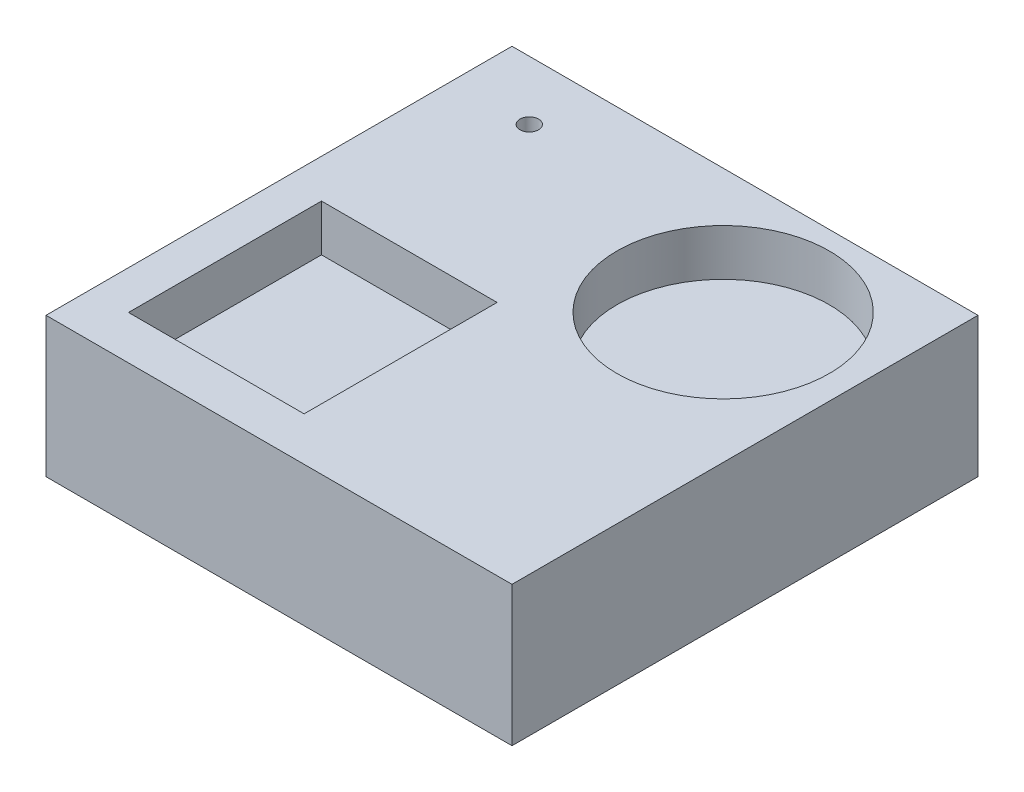
ISO-10303-21;
HEADER;
FILE_DESCRIPTION(('STEP AP214'),'2;1');
FILE_NAME('part.step','',(''),(''),'','','');
FILE_SCHEMA(('AUTOMOTIVE_DESIGN { 1 0 10303 214 1 1 1 1 }'));
ENDSEC;
DATA;
#1=APPLICATION_CONTEXT('core data for automotive mechanical design processes');
#2=APPLICATION_PROTOCOL_DEFINITION('international standard','automotive_design',2000,#1);
#3=PRODUCT_CONTEXT('',#1,'mechanical');
#4=PRODUCT('Part','Part','',(#3));
#5=PRODUCT_RELATED_PRODUCT_CATEGORY('part','',(#4));
#6=PRODUCT_DEFINITION_FORMATION('','',#4);
#7=PRODUCT_DEFINITION_CONTEXT('part definition',#1,'design');
#8=PRODUCT_DEFINITION('design','',#6,#7);
#9=PRODUCT_DEFINITION_SHAPE('','',#8);
#10=(LENGTH_UNIT() NAMED_UNIT(*) SI_UNIT(.MILLI.,.METRE.));
#11=(NAMED_UNIT(*) PLANE_ANGLE_UNIT() SI_UNIT($,.RADIAN.));
#12=(NAMED_UNIT(*) SI_UNIT($,.STERADIAN.) SOLID_ANGLE_UNIT());
#13=UNCERTAINTY_MEASURE_WITH_UNIT(LENGTH_MEASURE(1.E-05),#10,'distance_accuracy_value','');
#14=(GEOMETRIC_REPRESENTATION_CONTEXT(3) GLOBAL_UNCERTAINTY_ASSIGNED_CONTEXT((#13)) GLOBAL_UNIT_ASSIGNED_CONTEXT((#10,
#11,#12)) REPRESENTATION_CONTEXT('',''));
#15=CARTESIAN_POINT('',(0.,0.,0.));
#16=DIRECTION('',(0.,0.,1.));
#17=DIRECTION('',(1.,0.,0.));
#18=AXIS2_PLACEMENT_3D('',#15,#16,#17);
#19=CARTESIAN_POINT('',(0.,30.,0.));
#20=DIRECTION('',(1.,0.,0.));
#21=DIRECTION('',(0.,0.,-1.));
#22=AXIS2_PLACEMENT_3D('',#19,#20,#21);
#23=PLANE('',#22);
#24=DIRECTION('',(0.,0.,1.));
#25=VECTOR('',#24,1.);
#26=CARTESIAN_POINT('',(0.,0.,0.));
#27=LINE('',#26,#25);
#28=CARTESIAN_POINT('',(0.,0.,-100.));
#29=VERTEX_POINT('',#28);
#30=CARTESIAN_POINT('',(0.,0.,0.));
#31=VERTEX_POINT('',#30);
#32=EDGE_CURVE('E252',#29,#31,#27,.T.);
#33=ORIENTED_EDGE('',*,*,#32,.T.);
#34=DIRECTION('',(0.,-1.,0.));
#35=VECTOR('',#34,1.);
#36=CARTESIAN_POINT('',(0.,30.,0.));
#37=LINE('',#36,#35);
#38=CARTESIAN_POINT('',(0.,30.,0.));
#39=VERTEX_POINT('',#38);
#40=EDGE_CURVE('E12',#39,#31,#37,.T.);
#41=ORIENTED_EDGE('',*,*,#40,.F.);
#42=DIRECTION('',(0.,0.,1.));
#43=VECTOR('',#42,1.);
#44=CARTESIAN_POINT('',(0.,30.,0.));
#45=LINE('',#44,#43);
#46=CARTESIAN_POINT('',(0.,30.,-100.));
#47=VERTEX_POINT('',#46);
#48=EDGE_CURVE('E235',#47,#39,#45,.T.);
#49=ORIENTED_EDGE('',*,*,#48,.F.);
#50=DIRECTION('',(0.,-1.,0.));
#51=VECTOR('',#50,1.);
#52=CARTESIAN_POINT('',(0.,30.,-100.));
#53=LINE('',#52,#51);
#54=EDGE_CURVE('E251',#47,#29,#53,.T.);
#55=ORIENTED_EDGE('',*,*,#54,.T.);
#56=EDGE_LOOP('',(#33,#41,#49,#55));
#57=FACE_BOUND('',#56,.T.);
#58=ADVANCED_FACE('F47',(#57),#23,.F.);
#59=CARTESIAN_POINT('',(0.,30.,0.));
#60=DIRECTION('',(0.,0.,-1.));
#61=DIRECTION('',(-1.,0.,0.));
#62=AXIS2_PLACEMENT_3D('',#59,#60,#61);
#63=PLANE('',#62);
#64=DIRECTION('',(1.,0.,0.));
#65=VECTOR('',#64,1.);
#66=CARTESIAN_POINT('',(0.,0.,0.));
#67=LINE('',#66,#65);
#68=CARTESIAN_POINT('',(100.,0.,0.));
#69=VERTEX_POINT('',#68);
#70=EDGE_CURVE('E256',#31,#69,#67,.T.);
#71=ORIENTED_EDGE('',*,*,#70,.T.);
#72=DIRECTION('',(0.,-1.,0.));
#73=VECTOR('',#72,1.);
#74=CARTESIAN_POINT('',(100.,30.,0.));
#75=LINE('',#74,#73);
#76=CARTESIAN_POINT('',(100.,30.,0.));
#77=VERTEX_POINT('',#76);
#78=EDGE_CURVE('E55',#77,#69,#75,.T.);
#79=ORIENTED_EDGE('',*,*,#78,.F.);
#80=DIRECTION('',(1.,0.,0.));
#81=VECTOR('',#80,1.);
#82=CARTESIAN_POINT('',(0.,30.,0.));
#83=LINE('',#82,#81);
#84=EDGE_CURVE('E99',#39,#77,#83,.T.);
#85=ORIENTED_EDGE('',*,*,#84,.F.);
#86=ORIENTED_EDGE('',*,*,#40,.T.);
#87=EDGE_LOOP('',(#71,#79,#85,#86));
#88=FACE_BOUND('',#87,.T.);
#89=ADVANCED_FACE('F311',(#88),#63,.F.);
#90=CARTESIAN_POINT('',(100.,30.,0.));
#91=DIRECTION('',(-1.,0.,0.));
#92=DIRECTION('',(0.,0.,1.));
#93=AXIS2_PLACEMENT_3D('',#90,#91,#92);
#94=PLANE('',#93);
#95=DIRECTION('',(0.,0.,-1.));
#96=VECTOR('',#95,1.);
#97=CARTESIAN_POINT('',(100.,0.,0.));
#98=LINE('',#97,#96);
#99=CARTESIAN_POINT('',(100.,0.,-100.));
#100=VERTEX_POINT('',#99);
#101=EDGE_CURVE('E259',#69,#100,#98,.T.);
#102=ORIENTED_EDGE('',*,*,#101,.T.);
#103=DIRECTION('',(0.,-1.,0.));
#104=VECTOR('',#103,1.);
#105=CARTESIAN_POINT('',(100.,30.,-100.));
#106=LINE('',#105,#104);
#107=CARTESIAN_POINT('',(100.,30.,-100.));
#108=VERTEX_POINT('',#107);
#109=EDGE_CURVE('E286',#108,#100,#106,.T.);
#110=ORIENTED_EDGE('',*,*,#109,.F.);
#111=DIRECTION('',(0.,0.,-1.));
#112=VECTOR('',#111,1.);
#113=CARTESIAN_POINT('',(100.,30.,0.));
#114=LINE('',#113,#112);
#115=EDGE_CURVE('E245',#77,#108,#114,.T.);
#116=ORIENTED_EDGE('',*,*,#115,.F.);
#117=ORIENTED_EDGE('',*,*,#78,.T.);
#118=EDGE_LOOP('',(#102,#110,#116,#117));
#119=FACE_BOUND('',#118,.T.);
#120=ADVANCED_FACE('F293',(#119),#94,.F.);
#121=CARTESIAN_POINT('',(0.,30.,-100.));
#122=DIRECTION('',(0.,0.,1.));
#123=DIRECTION('',(1.,0.,0.));
#124=AXIS2_PLACEMENT_3D('',#121,#122,#123);
#125=PLANE('',#124);
#126=DIRECTION('',(-1.,0.,0.));
#127=VECTOR('',#126,1.);
#128=CARTESIAN_POINT('',(0.,0.,-100.));
#129=LINE('',#128,#127);
#130=EDGE_CURVE('E92',#100,#29,#129,.T.);
#131=ORIENTED_EDGE('',*,*,#130,.T.);
#132=ORIENTED_EDGE('',*,*,#54,.F.);
#133=DIRECTION('',(-1.,0.,0.));
#134=VECTOR('',#133,1.);
#135=CARTESIAN_POINT('',(0.,30.,-100.));
#136=LINE('',#135,#134);
#137=EDGE_CURVE('E71',#108,#47,#136,.T.);
#138=ORIENTED_EDGE('',*,*,#137,.F.);
#139=ORIENTED_EDGE('',*,*,#109,.T.);
#140=EDGE_LOOP('',(#131,#132,#138,#139));
#141=FACE_BOUND('',#140,.T.);
#142=ADVANCED_FACE('F301',(#141),#125,.F.);
#143=CARTESIAN_POINT('',(0.,30.,0.));
#144=DIRECTION('',(0.,-1.,0.));
#145=DIRECTION('',(0.,0.,-1.));
#146=AXIS2_PLACEMENT_3D('',#143,#144,#145);
#147=PLANE('',#146);
#148=DIRECTION('',(1.,0.,0.));
#149=VECTOR('',#148,1.);
#150=CARTESIAN_POINT('',(8.32789443786908,30.,-9.37411485810458));
#151=LINE('',#150,#149);
#152=CARTESIAN_POINT('',(8.32789443786908,30.,-9.37411485810458));
#153=VERTEX_POINT('',#152);
#154=CARTESIAN_POINT('',(46.0113838607228,30.,-9.37411485810458));
#155=VERTEX_POINT('',#154);
#156=EDGE_CURVE('E170',#153,#155,#151,.T.);
#157=ORIENTED_EDGE('',*,*,#156,.F.);
#158=DIRECTION('',(0.,0.,1.));
#159=VECTOR('',#158,1.);
#160=CARTESIAN_POINT('',(8.32789443786908,30.,-50.787427560806));
#161=LINE('',#160,#159);
#162=CARTESIAN_POINT('',(8.32789443786908,30.,-50.787427560806));
#163=VERTEX_POINT('',#162);
#164=EDGE_CURVE('E62',#163,#153,#161,.T.);
#165=ORIENTED_EDGE('',*,*,#164,.F.);
#166=DIRECTION('',(-1.,0.,0.));
#167=VECTOR('',#166,1.);
#168=CARTESIAN_POINT('',(8.32789443786908,30.,-50.787427560806));
#169=LINE('',#168,#167);
#170=CARTESIAN_POINT('',(46.0113838607228,30.,-50.787427560806));
#171=VERTEX_POINT('',#170);
#172=EDGE_CURVE('E145',#171,#163,#169,.T.);
#173=ORIENTED_EDGE('',*,*,#172,.F.);
#174=DIRECTION('',(0.,0.,-1.));
#175=VECTOR('',#174,1.);
#176=CARTESIAN_POINT('',(46.0113838607228,30.,-50.787427560806));
#177=LINE('',#176,#175);
#178=EDGE_CURVE('E149',#155,#171,#177,.T.);
#179=ORIENTED_EDGE('',*,*,#178,.F.);
#180=EDGE_LOOP('',(#157,#165,#173,#179));
#181=FACE_BOUND('',#180,.T.);
#182=CARTESIAN_POINT('',(72.0846402277573,30.,-73.2251707576097));
#183=DIRECTION('',(0.,1.,0.));
#184=DIRECTION('',(0.,0.,1.));
#185=AXIS2_PLACEMENT_3D('',#182,#183,#184);
#186=CIRCLE('',#185,22.7899638797003);
#187=CARTESIAN_POINT('',(72.0846402277573,30.,-50.4352068779094));
#188=VERTEX_POINT('',#187);
#189=EDGE_CURVE('E204',#188,#188,#186,.T.);
#190=ORIENTED_EDGE('',*,*,#189,.F.);
#191=EDGE_LOOP('',(#190));
#192=FACE_BOUND('',#191,.T.);
#193=CARTESIAN_POINT('',(16.3843135452169,30.,-87.3231980243077));
#194=DIRECTION('',(0.,1.,0.));
#195=DIRECTION('',(0.,0.,1.));
#196=AXIS2_PLACEMENT_3D('',#193,#194,#195);
#197=CIRCLE('',#196,2.);
#198=CARTESIAN_POINT('',(16.3843135452169,30.,-85.3231980243077));
#199=VERTEX_POINT('',#198);
#200=EDGE_CURVE('E188',#199,#199,#197,.T.);
#201=ORIENTED_EDGE('',*,*,#200,.F.);
#202=EDGE_LOOP('',(#201));
#203=FACE_BOUND('',#202,.T.);
#204=ORIENTED_EDGE('',*,*,#48,.T.);
#205=ORIENTED_EDGE('',*,*,#84,.T.);
#206=ORIENTED_EDGE('',*,*,#115,.T.);
#207=ORIENTED_EDGE('',*,*,#137,.T.);
#208=EDGE_LOOP('',(#204,#205,#206,#207));
#209=FACE_BOUND('',#208,.T.);
#210=ADVANCED_FACE('F303',(#181,#192,#203,#209),#147,.F.);
#211=CARTESIAN_POINT('',(0.,0.,0.));
#212=DIRECTION('',(0.,-1.,0.));
#213=DIRECTION('',(0.,0.,-1.));
#214=AXIS2_PLACEMENT_3D('',#211,#212,#213);
#215=PLANE('',#214);
#216=CARTESIAN_POINT('',(16.3843135452169,0.,-87.3231980243077));
#217=DIRECTION('',(0.,1.,0.));
#218=DIRECTION('',(0.,0.,1.));
#219=AXIS2_PLACEMENT_3D('',#216,#217,#218);
#220=CIRCLE('',#219,2.);
#221=CARTESIAN_POINT('',(16.3843135452169,0.,-85.3231980243077));
#222=VERTEX_POINT('',#221);
#223=EDGE_CURVE('E233',#222,#222,#220,.T.);
#224=ORIENTED_EDGE('',*,*,#223,.T.);
#225=EDGE_LOOP('',(#224));
#226=FACE_BOUND('',#225,.T.);
#227=ORIENTED_EDGE('',*,*,#32,.F.);
#228=ORIENTED_EDGE('',*,*,#130,.F.);
#229=ORIENTED_EDGE('',*,*,#101,.F.);
#230=ORIENTED_EDGE('',*,*,#70,.F.);
#231=EDGE_LOOP('',(#227,#228,#229,#230));
#232=FACE_BOUND('',#231,.T.);
#233=ADVANCED_FACE('F297',(#226,#232),#215,.T.);
#234=CARTESIAN_POINT('',(16.3843135452169,0.,-87.3231980243077));
#235=DIRECTION('',(0.,1.,0.));
#236=DIRECTION('',(0.,0.,1.));
#237=AXIS2_PLACEMENT_3D('',#234,#235,#236);
#238=CYLINDRICAL_SURFACE('',#237,2.);
#239=ORIENTED_EDGE('',*,*,#223,.F.);
#240=EDGE_LOOP('',(#239));
#241=FACE_BOUND('',#240,.T.);
#242=ORIENTED_EDGE('',*,*,#200,.T.);
#243=EDGE_LOOP('',(#242));
#244=FACE_BOUND('',#243,.T.);
#245=ADVANCED_FACE('F343',(#241,#244),#238,.F.);
#246=CARTESIAN_POINT('',(72.0846402277573,20.,-73.2251707576097));
#247=DIRECTION('',(0.,1.,0.));
#248=DIRECTION('',(0.,0.,1.));
#249=AXIS2_PLACEMENT_3D('',#246,#247,#248);
#250=CYLINDRICAL_SURFACE('',#249,22.7899638797003);
#251=CARTESIAN_POINT('',(72.0846402277573,20.,-73.2251707576097));
#252=DIRECTION('',(0.,1.,0.));
#253=DIRECTION('',(0.,0.,1.));
#254=AXIS2_PLACEMENT_3D('',#251,#252,#253);
#255=CIRCLE('',#254,22.7899638797003);
#256=CARTESIAN_POINT('',(72.0846402277573,20.,-50.4352068779094));
#257=VERTEX_POINT('',#256);
#258=EDGE_CURVE('E171',#257,#257,#255,.T.);
#259=ORIENTED_EDGE('',*,*,#258,.F.);
#260=EDGE_LOOP('',(#259));
#261=FACE_BOUND('',#260,.T.);
#262=ORIENTED_EDGE('',*,*,#189,.T.);
#263=EDGE_LOOP('',(#262));
#264=FACE_BOUND('',#263,.T.);
#265=ADVANCED_FACE('F350',(#261,#264),#250,.F.);
#266=CARTESIAN_POINT('',(72.0846402277573,20.,-73.2251707576097));
#267=DIRECTION('',(0.,1.,0.));
#268=DIRECTION('',(0.,0.,1.));
#269=AXIS2_PLACEMENT_3D('',#266,#267,#268);
#270=PLANE('',#269);
#271=ORIENTED_EDGE('',*,*,#258,.T.);
#272=EDGE_LOOP('',(#271));
#273=FACE_BOUND('',#272,.T.);
#274=ADVANCED_FACE('F360',(#273),#270,.T.);
#275=CARTESIAN_POINT('',(8.32789443786908,20.,-50.787427560806));
#276=DIRECTION('',(-1.,0.,0.));
#277=DIRECTION('',(0.,0.,1.));
#278=AXIS2_PLACEMENT_3D('',#275,#276,#277);
#279=PLANE('',#278);
#280=ORIENTED_EDGE('',*,*,#164,.T.);
#281=DIRECTION('',(0.,1.,0.));
#282=VECTOR('',#281,1.);
#283=CARTESIAN_POINT('',(8.32789443786908,20.,-9.37411485810458));
#284=LINE('',#283,#282);
#285=CARTESIAN_POINT('',(8.32789443786908,20.,-9.37411485810458));
#286=VERTEX_POINT('',#285);
#287=EDGE_CURVE('E119',#286,#153,#284,.T.);
#288=ORIENTED_EDGE('',*,*,#287,.F.);
#289=DIRECTION('',(0.,0.,1.));
#290=VECTOR('',#289,1.);
#291=CARTESIAN_POINT('',(8.32789443786908,20.,-50.787427560806));
#292=LINE('',#291,#290);
#293=CARTESIAN_POINT('',(8.32789443786908,20.,-50.787427560806));
#294=VERTEX_POINT('',#293);
#295=EDGE_CURVE('E123',#294,#286,#292,.T.);
#296=ORIENTED_EDGE('',*,*,#295,.F.);
#297=DIRECTION('',(0.,1.,0.));
#298=VECTOR('',#297,1.);
#299=CARTESIAN_POINT('',(8.32789443786908,20.,-50.787427560806));
#300=LINE('',#299,#298);
#301=EDGE_CURVE('E184',#294,#163,#300,.T.);
#302=ORIENTED_EDGE('',*,*,#301,.T.);
#303=EDGE_LOOP('',(#280,#288,#296,#302));
#304=FACE_BOUND('',#303,.T.);
#305=ADVANCED_FACE('F121',(#304),#279,.F.);
#306=CARTESIAN_POINT('',(8.32789443786908,20.,-50.787427560806));
#307=DIRECTION('',(0.,0.,-1.));
#308=DIRECTION('',(-1.,0.,0.));
#309=AXIS2_PLACEMENT_3D('',#306,#307,#308);
#310=PLANE('',#309);
#311=ORIENTED_EDGE('',*,*,#172,.T.);
#312=ORIENTED_EDGE('',*,*,#301,.F.);
#313=DIRECTION('',(-1.,0.,0.));
#314=VECTOR('',#313,1.);
#315=CARTESIAN_POINT('',(8.32789443786908,20.,-50.787427560806));
#316=LINE('',#315,#314);
#317=CARTESIAN_POINT('',(46.0113838607228,20.,-50.787427560806));
#318=VERTEX_POINT('',#317);
#319=EDGE_CURVE('E130',#318,#294,#316,.T.);
#320=ORIENTED_EDGE('',*,*,#319,.F.);
#321=DIRECTION('',(0.,1.,0.));
#322=VECTOR('',#321,1.);
#323=CARTESIAN_POINT('',(46.0113838607228,20.,-50.787427560806));
#324=LINE('',#323,#322);
#325=EDGE_CURVE('E189',#318,#171,#324,.T.);
#326=ORIENTED_EDGE('',*,*,#325,.T.);
#327=EDGE_LOOP('',(#311,#312,#320,#326));
#328=FACE_BOUND('',#327,.T.);
#329=ADVANCED_FACE('F379',(#328),#310,.F.);
#330=CARTESIAN_POINT('',(46.0113838607228,20.,-50.787427560806));
#331=DIRECTION('',(1.,0.,0.));
#332=DIRECTION('',(0.,0.,-1.));
#333=AXIS2_PLACEMENT_3D('',#330,#331,#332);
#334=PLANE('',#333);
#335=ORIENTED_EDGE('',*,*,#178,.T.);
#336=ORIENTED_EDGE('',*,*,#325,.F.);
#337=DIRECTION('',(0.,0.,-1.));
#338=VECTOR('',#337,1.);
#339=CARTESIAN_POINT('',(46.0113838607228,20.,-50.787427560806));
#340=LINE('',#339,#338);
#341=CARTESIAN_POINT('',(46.0113838607228,20.,-9.37411485810458));
#342=VERTEX_POINT('',#341);
#343=EDGE_CURVE('E139',#342,#318,#340,.T.);
#344=ORIENTED_EDGE('',*,*,#343,.F.);
#345=DIRECTION('',(0.,1.,0.));
#346=VECTOR('',#345,1.);
#347=CARTESIAN_POINT('',(46.0113838607228,20.,-9.37411485810458));
#348=LINE('',#347,#346);
#349=EDGE_CURVE('E129',#342,#155,#348,.T.);
#350=ORIENTED_EDGE('',*,*,#349,.T.);
#351=EDGE_LOOP('',(#335,#336,#344,#350));
#352=FACE_BOUND('',#351,.T.);
#353=ADVANCED_FACE('F389',(#352),#334,.F.);
#354=CARTESIAN_POINT('',(8.32789443786908,20.,-9.37411485810458));
#355=DIRECTION('',(0.,0.,1.));
#356=DIRECTION('',(1.,0.,0.));
#357=AXIS2_PLACEMENT_3D('',#354,#355,#356);
#358=PLANE('',#357);
#359=ORIENTED_EDGE('',*,*,#156,.T.);
#360=ORIENTED_EDGE('',*,*,#349,.F.);
#361=DIRECTION('',(1.,0.,0.));
#362=VECTOR('',#361,1.);
#363=CARTESIAN_POINT('',(8.32789443786908,20.,-9.37411485810458));
#364=LINE('',#363,#362);
#365=EDGE_CURVE('E133',#286,#342,#364,.T.);
#366=ORIENTED_EDGE('',*,*,#365,.F.);
#367=ORIENTED_EDGE('',*,*,#287,.T.);
#368=EDGE_LOOP('',(#359,#360,#366,#367));
#369=FACE_BOUND('',#368,.T.);
#370=ADVANCED_FACE('F134',(#369),#358,.F.);
#371=CARTESIAN_POINT('',(0.,20.,0.));
#372=DIRECTION('',(0.,1.,0.));
#373=DIRECTION('',(0.,0.,1.));
#374=AXIS2_PLACEMENT_3D('',#371,#372,#373);
#375=PLANE('',#374);
#376=ORIENTED_EDGE('',*,*,#295,.T.);
#377=ORIENTED_EDGE('',*,*,#365,.T.);
#378=ORIENTED_EDGE('',*,*,#343,.T.);
#379=ORIENTED_EDGE('',*,*,#319,.T.);
#380=EDGE_LOOP('',(#376,#377,#378,#379));
#381=FACE_BOUND('',#380,.T.);
#382=ADVANCED_FACE('F142',(#381),#375,.T.);
#383=CLOSED_SHELL('',(#58,#89,#120,#142,#210,#233,#245,#265,#274,#305,#329,#353,#370,#382));
#384=MANIFOLD_SOLID_BREP('B2',#383);
#385=ADVANCED_BREP_SHAPE_REPRESENTATION('',(#18,#384),#14);
#386=SHAPE_DEFINITION_REPRESENTATION(#9,#385);
ENDSEC;
END-ISO-10303-21;
